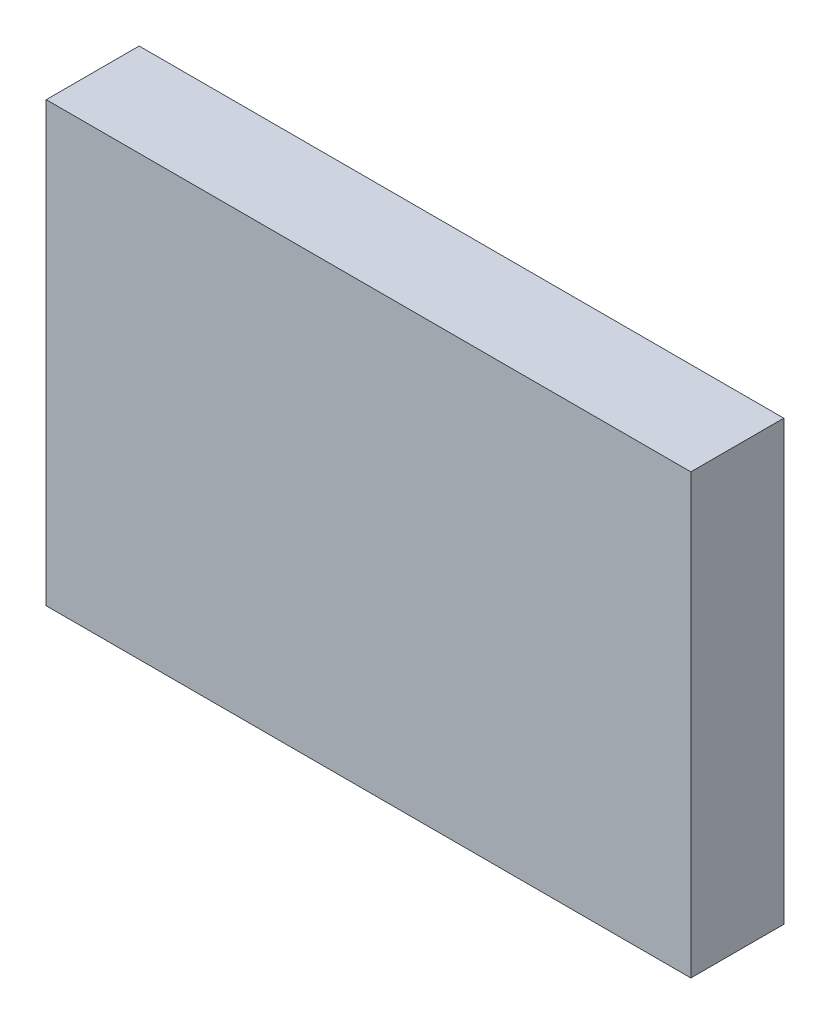
ISO-10303-21;
HEADER;
FILE_DESCRIPTION(('STEP AP214'),'2;1');
FILE_NAME('part.step','',(''),(''),'','','');
FILE_SCHEMA(('AUTOMOTIVE_DESIGN { 1 0 10303 214 1 1 1 1 }'));
ENDSEC;
DATA;
#1=APPLICATION_CONTEXT('core data for automotive mechanical design processes');
#2=APPLICATION_PROTOCOL_DEFINITION('international standard','automotive_design',2000,#1);
#3=PRODUCT_CONTEXT('',#1,'mechanical');
#4=PRODUCT('Part','Part','',(#3));
#5=PRODUCT_RELATED_PRODUCT_CATEGORY('part','',(#4));
#6=PRODUCT_DEFINITION_FORMATION('','',#4);
#7=PRODUCT_DEFINITION_CONTEXT('part definition',#1,'design');
#8=PRODUCT_DEFINITION('design','',#6,#7);
#9=PRODUCT_DEFINITION_SHAPE('','',#8);
#10=(LENGTH_UNIT() NAMED_UNIT(*) SI_UNIT(.MILLI.,.METRE.));
#11=(NAMED_UNIT(*) PLANE_ANGLE_UNIT() SI_UNIT($,.RADIAN.));
#12=(NAMED_UNIT(*) SI_UNIT($,.STERADIAN.) SOLID_ANGLE_UNIT());
#13=UNCERTAINTY_MEASURE_WITH_UNIT(LENGTH_MEASURE(1.E-05),#10,'distance_accuracy_value','');
#14=(GEOMETRIC_REPRESENTATION_CONTEXT(3) GLOBAL_UNCERTAINTY_ASSIGNED_CONTEXT((#13)) GLOBAL_UNIT_ASSIGNED_CONTEXT((#10,
#11,#12)) REPRESENTATION_CONTEXT('',''));
#15=CARTESIAN_POINT('',(0.,0.,0.));
#16=DIRECTION('',(0.,0.,1.));
#17=DIRECTION('',(1.,0.,0.));
#18=AXIS2_PLACEMENT_3D('',#15,#16,#17);
#19=CARTESIAN_POINT('',(0.,1.269999991291E-06,0.71000112));
#20=DIRECTION('',(0.,0.,-1.));
#21=DIRECTION('',(-1.,0.,0.));
#22=AXIS2_PLACEMENT_3D('',#19,#20,#21);
#23=PLANE('',#22);
#24=DIRECTION('',(0.,1.,0.));
#25=VECTOR('',#24,1.);
#26=CARTESIAN_POINT('',(2.4624919,1.67449246,0.71000112));
#27=LINE('',#26,#25);
#28=CARTESIAN_POINT('',(2.4624919,1.67449246,0.71000112));
#29=VERTEX_POINT('',#28);
#30=CARTESIAN_POINT('',(2.4624919,-1.67448992,0.71000112));
#31=VERTEX_POINT('',#30);
#32=EDGE_CURVE('E68',#29,#31,#27,.F.);
#33=ORIENTED_EDGE('',*,*,#32,.F.);
#34=DIRECTION('',(1.,0.,0.));
#35=VECTOR('',#34,1.);
#36=CARTESIAN_POINT('',(-2.4624919,1.67449246,0.71000112));
#37=LINE('',#36,#35);
#38=CARTESIAN_POINT('',(-2.4624919,1.67449246,0.71000112));
#39=VERTEX_POINT('',#38);
#40=EDGE_CURVE('E55',#39,#29,#37,.T.);
#41=ORIENTED_EDGE('',*,*,#40,.F.);
#42=DIRECTION('',(0.,1.,0.));
#43=VECTOR('',#42,1.);
#44=CARTESIAN_POINT('',(-2.4624919,-1.67448992,0.71000112));
#45=LINE('',#44,#43);
#46=CARTESIAN_POINT('',(-2.4624919,-1.67448992,0.71000112));
#47=VERTEX_POINT('',#46);
#48=EDGE_CURVE('E20',#47,#39,#45,.T.);
#49=ORIENTED_EDGE('',*,*,#48,.F.);
#50=DIRECTION('',(1.,0.,0.));
#51=VECTOR('',#50,1.);
#52=CARTESIAN_POINT('',(2.4624919,-1.67448992,0.71000112));
#53=LINE('',#52,#51);
#54=EDGE_CURVE('E80',#31,#47,#53,.F.);
#55=ORIENTED_EDGE('',*,*,#54,.F.);
#56=EDGE_LOOP('',(#33,#41,#49,#55));
#57=FACE_BOUND('',#56,.T.);
#58=ADVANCED_FACE('F17',(#57),#23,.F.);
#59=CARTESIAN_POINT('',(-2.4624919,-1.67448992,0.));
#60=DIRECTION('',(-1.,0.,0.));
#61=DIRECTION('',(0.,0.,1.));
#62=AXIS2_PLACEMENT_3D('',#59,#60,#61);
#63=PLANE('',#62);
#64=DIRECTION('',(0.,0.,1.));
#65=VECTOR('',#64,1.);
#66=CARTESIAN_POINT('',(-2.4624919,1.67449246,0.));
#67=LINE('',#66,#65);
#68=CARTESIAN_POINT('',(-2.4624919,1.67449246,0.));
#69=VERTEX_POINT('',#68);
#70=EDGE_CURVE('E61',#69,#39,#67,.T.);
#71=ORIENTED_EDGE('',*,*,#70,.F.);
#72=DIRECTION('',(0.,1.,0.));
#73=VECTOR('',#72,1.);
#74=CARTESIAN_POINT('',(-2.4624919,1.269999991291E-06,0.));
#75=LINE('',#74,#73);
#76=CARTESIAN_POINT('',(-2.4624919,-1.67448992,0.));
#77=VERTEX_POINT('',#76);
#78=EDGE_CURVE('E83',#77,#69,#75,.T.);
#79=ORIENTED_EDGE('',*,*,#78,.F.);
#80=DIRECTION('',(0.,0.,-1.));
#81=VECTOR('',#80,1.);
#82=CARTESIAN_POINT('',(-2.4624919,-1.67448992,0.));
#83=LINE('',#82,#81);
#84=EDGE_CURVE('E64',#47,#77,#83,.T.);
#85=ORIENTED_EDGE('',*,*,#84,.F.);
#86=ORIENTED_EDGE('',*,*,#48,.T.);
#87=EDGE_LOOP('',(#71,#79,#85,#86));
#88=FACE_BOUND('',#87,.T.);
#89=ADVANCED_FACE('F60',(#88),#63,.T.);
#90=CARTESIAN_POINT('',(-2.4624919,1.67449246,0.));
#91=DIRECTION('',(0.,1.,0.));
#92=DIRECTION('',(0.,0.,1.));
#93=AXIS2_PLACEMENT_3D('',#90,#91,#92);
#94=PLANE('',#93);
#95=DIRECTION('',(0.,0.,-1.));
#96=VECTOR('',#95,1.);
#97=CARTESIAN_POINT('',(2.4624919,1.67449246,0.));
#98=LINE('',#97,#96);
#99=CARTESIAN_POINT('',(2.4624919,1.67449246,0.));
#100=VERTEX_POINT('',#99);
#101=EDGE_CURVE('E70',#100,#29,#98,.F.);
#102=ORIENTED_EDGE('',*,*,#101,.F.);
#103=DIRECTION('',(-1.,0.,0.));
#104=VECTOR('',#103,1.);
#105=CARTESIAN_POINT('',(0.,1.67449246,0.));
#106=LINE('',#105,#104);
#107=EDGE_CURVE('E74',#69,#100,#106,.F.);
#108=ORIENTED_EDGE('',*,*,#107,.F.);
#109=ORIENTED_EDGE('',*,*,#70,.T.);
#110=ORIENTED_EDGE('',*,*,#40,.T.);
#111=EDGE_LOOP('',(#102,#108,#109,#110));
#112=FACE_BOUND('',#111,.T.);
#113=ADVANCED_FACE('F72',(#112),#94,.T.);
#114=CARTESIAN_POINT('',(2.4624919,1.67449246,0.));
#115=DIRECTION('',(1.,0.,0.));
#116=DIRECTION('',(0.,0.,-1.));
#117=AXIS2_PLACEMENT_3D('',#114,#115,#116);
#118=PLANE('',#117);
#119=DIRECTION('',(0.,0.,-1.));
#120=VECTOR('',#119,1.);
#121=CARTESIAN_POINT('',(2.4624919,-1.67448992,0.));
#122=LINE('',#121,#120);
#123=CARTESIAN_POINT('',(2.4624919,-1.67448992,0.));
#124=VERTEX_POINT('',#123);
#125=EDGE_CURVE('E35',#124,#31,#122,.F.);
#126=ORIENTED_EDGE('',*,*,#125,.F.);
#127=DIRECTION('',(0.,1.,0.));
#128=VECTOR('',#127,1.);
#129=CARTESIAN_POINT('',(2.4624919,1.269999991291E-06,0.));
#130=LINE('',#129,#128);
#131=EDGE_CURVE('E26',#100,#124,#130,.F.);
#132=ORIENTED_EDGE('',*,*,#131,.F.);
#133=ORIENTED_EDGE('',*,*,#101,.T.);
#134=ORIENTED_EDGE('',*,*,#32,.T.);
#135=EDGE_LOOP('',(#126,#132,#133,#134));
#136=FACE_BOUND('',#135,.T.);
#137=ADVANCED_FACE('F89',(#136),#118,.T.);
#138=CARTESIAN_POINT('',(2.4624919,-1.67448992,0.));
#139=DIRECTION('',(0.,-1.,0.));
#140=DIRECTION('',(0.,0.,-1.));
#141=AXIS2_PLACEMENT_3D('',#138,#139,#140);
#142=PLANE('',#141);
#143=ORIENTED_EDGE('',*,*,#84,.T.);
#144=DIRECTION('',(-1.,0.,0.));
#145=VECTOR('',#144,1.);
#146=CARTESIAN_POINT('',(0.,-1.67448992,0.));
#147=LINE('',#146,#145);
#148=EDGE_CURVE('E11',#124,#77,#147,.T.);
#149=ORIENTED_EDGE('',*,*,#148,.F.);
#150=ORIENTED_EDGE('',*,*,#125,.T.);
#151=ORIENTED_EDGE('',*,*,#54,.T.);
#152=EDGE_LOOP('',(#143,#149,#150,#151));
#153=FACE_BOUND('',#152,.T.);
#154=ADVANCED_FACE('F91',(#153),#142,.T.);
#155=CARTESIAN_POINT('',(0.,1.269999991291E-06,0.));
#156=DIRECTION('',(0.,0.,-1.));
#157=DIRECTION('',(-1.,0.,0.));
#158=AXIS2_PLACEMENT_3D('',#155,#156,#157);
#159=PLANE('',#158);
#160=ORIENTED_EDGE('',*,*,#131,.T.);
#161=ORIENTED_EDGE('',*,*,#148,.T.);
#162=ORIENTED_EDGE('',*,*,#78,.T.);
#163=ORIENTED_EDGE('',*,*,#107,.T.);
#164=EDGE_LOOP('',(#160,#161,#162,#163));
#165=FACE_BOUND('',#164,.T.);
#166=ADVANCED_FACE('F88',(#165),#159,.T.);
#167=CLOSED_SHELL('',(#58,#89,#113,#137,#154,#166));
#168=MANIFOLD_SOLID_BREP('B1',#167);
#169=ADVANCED_BREP_SHAPE_REPRESENTATION('',(#18,#168),#14);
#170=SHAPE_DEFINITION_REPRESENTATION(#9,#169);
ENDSEC;
END-ISO-10303-21;
